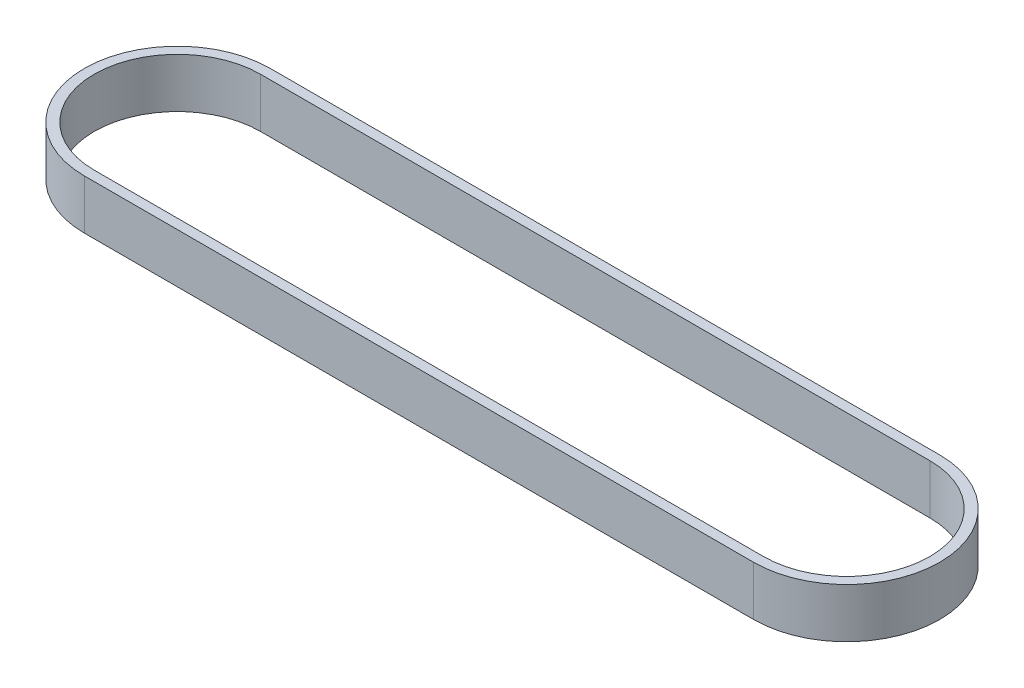
ISO-10303-21;
HEADER;
FILE_DESCRIPTION(('STEP AP214'),'2;1');
FILE_NAME('part.step','',(''),(''),'','','');
FILE_SCHEMA(('AUTOMOTIVE_DESIGN { 1 0 10303 214 1 1 1 1 }'));
ENDSEC;
DATA;
#1=APPLICATION_CONTEXT('core data for automotive mechanical design processes');
#2=APPLICATION_PROTOCOL_DEFINITION('international standard','automotive_design',2000,#1);
#3=PRODUCT_CONTEXT('',#1,'mechanical');
#4=PRODUCT('Part','Part','',(#3));
#5=PRODUCT_RELATED_PRODUCT_CATEGORY('part','',(#4));
#6=PRODUCT_DEFINITION_FORMATION('','',#4);
#7=PRODUCT_DEFINITION_CONTEXT('part definition',#1,'design');
#8=PRODUCT_DEFINITION('design','',#6,#7);
#9=PRODUCT_DEFINITION_SHAPE('','',#8);
#10=(LENGTH_UNIT() NAMED_UNIT(*) SI_UNIT(.MILLI.,.METRE.));
#11=(NAMED_UNIT(*) PLANE_ANGLE_UNIT() SI_UNIT($,.RADIAN.));
#12=(NAMED_UNIT(*) SI_UNIT($,.STERADIAN.) SOLID_ANGLE_UNIT());
#13=UNCERTAINTY_MEASURE_WITH_UNIT(LENGTH_MEASURE(1.E-05),#10,'distance_accuracy_value','');
#14=(GEOMETRIC_REPRESENTATION_CONTEXT(3) GLOBAL_UNCERTAINTY_ASSIGNED_CONTEXT((#13)) GLOBAL_UNIT_ASSIGNED_CONTEXT((#10,
#11,#12)) REPRESENTATION_CONTEXT('',''));
#15=CARTESIAN_POINT('',(0.,0.,0.));
#16=DIRECTION('',(0.,0.,1.));
#17=DIRECTION('',(1.,0.,0.));
#18=AXIS2_PLACEMENT_3D('',#15,#16,#17);
#19=CARTESIAN_POINT('',(0.,10.,0.));
#20=DIRECTION('',(0.,1.,0.));
#21=DIRECTION('',(0.,0.,1.));
#22=AXIS2_PLACEMENT_3D('',#19,#20,#21);
#23=PLANE('',#22);
#24=CARTESIAN_POINT('',(0.,10.,0.));
#25=DIRECTION('',(0.,1.,0.));
#26=DIRECTION('',(1.,0.,0.));
#27=AXIS2_PLACEMENT_3D('',#24,#25,#26);
#28=CIRCLE('',#27,18.76);
#29=CARTESIAN_POINT('',(0.,10.,-18.76));
#30=VERTEX_POINT('',#29);
#31=CARTESIAN_POINT('',(0.,10.,18.76));
#32=VERTEX_POINT('',#31);
#33=EDGE_CURVE('E158',#30,#32,#28,.T.);
#34=ORIENTED_EDGE('',*,*,#33,.T.);
#35=DIRECTION('',(1.,0.,0.));
#36=VECTOR('',#35,1.);
#37=CARTESIAN_POINT('',(0.,10.,18.76));
#38=LINE('',#37,#36);
#39=CARTESIAN_POINT('',(135.,10.,18.76));
#40=VERTEX_POINT('',#39);
#41=EDGE_CURVE('E161',#32,#40,#38,.T.);
#42=ORIENTED_EDGE('',*,*,#41,.T.);
#43=CARTESIAN_POINT('',(135.,10.,0.));
#44=DIRECTION('',(0.,1.,0.));
#45=DIRECTION('',(1.,0.,0.));
#46=AXIS2_PLACEMENT_3D('',#43,#44,#45);
#47=CIRCLE('',#46,18.76);
#48=CARTESIAN_POINT('',(135.,10.,-18.76));
#49=VERTEX_POINT('',#48);
#50=EDGE_CURVE('E164',#40,#49,#47,.T.);
#51=ORIENTED_EDGE('',*,*,#50,.T.);
#52=DIRECTION('',(-1.,0.,0.));
#53=VECTOR('',#52,1.);
#54=CARTESIAN_POINT('',(0.,10.,-18.76));
#55=LINE('',#54,#53);
#56=EDGE_CURVE('E166',#49,#30,#55,.T.);
#57=ORIENTED_EDGE('',*,*,#56,.T.);
#58=EDGE_LOOP('',(#34,#42,#51,#57));
#59=FACE_BOUND('',#58,.T.);
#60=DIRECTION('',(1.,0.,0.));
#61=VECTOR('',#60,1.);
#62=CARTESIAN_POINT('',(0.,10.,16.76));
#63=LINE('',#62,#61);
#64=CARTESIAN_POINT('',(0.,10.,16.76));
#65=VERTEX_POINT('',#64);
#66=CARTESIAN_POINT('',(135.,10.,16.76));
#67=VERTEX_POINT('',#66);
#68=EDGE_CURVE('E130',#65,#67,#63,.T.);
#69=ORIENTED_EDGE('',*,*,#68,.F.);
#70=CARTESIAN_POINT('',(0.,10.,0.));
#71=DIRECTION('',(0.,1.,0.));
#72=DIRECTION('',(1.,0.,0.));
#73=AXIS2_PLACEMENT_3D('',#70,#71,#72);
#74=CIRCLE('',#73,16.76);
#75=CARTESIAN_POINT('',(0.,10.,-16.76));
#76=VERTEX_POINT('',#75);
#77=EDGE_CURVE('E122',#76,#65,#74,.T.);
#78=ORIENTED_EDGE('',*,*,#77,.F.);
#79=DIRECTION('',(-1.,0.,0.));
#80=VECTOR('',#79,1.);
#81=CARTESIAN_POINT('',(0.,10.,-16.76));
#82=LINE('',#81,#80);
#83=CARTESIAN_POINT('',(135.,10.,-16.76));
#84=VERTEX_POINT('',#83);
#85=EDGE_CURVE('E144',#84,#76,#82,.T.);
#86=ORIENTED_EDGE('',*,*,#85,.F.);
#87=CARTESIAN_POINT('',(135.,10.,0.));
#88=DIRECTION('',(0.,1.,0.));
#89=DIRECTION('',(1.,0.,0.));
#90=AXIS2_PLACEMENT_3D('',#87,#88,#89);
#91=CIRCLE('',#90,16.76);
#92=EDGE_CURVE('E142',#67,#84,#91,.T.);
#93=ORIENTED_EDGE('',*,*,#92,.F.);
#94=EDGE_LOOP('',(#69,#78,#86,#93));
#95=FACE_BOUND('',#94,.T.);
#96=ADVANCED_FACE('F57',(#59,#95),#23,.T.);
#97=CARTESIAN_POINT('',(0.,0.,0.));
#98=DIRECTION('',(0.,1.,0.));
#99=DIRECTION('',(0.,0.,1.));
#100=AXIS2_PLACEMENT_3D('',#97,#98,#99);
#101=PLANE('',#100);
#102=CARTESIAN_POINT('',(0.,0.,0.));
#103=DIRECTION('',(0.,1.,0.));
#104=DIRECTION('',(1.,0.,0.));
#105=AXIS2_PLACEMENT_3D('',#102,#103,#104);
#106=CIRCLE('',#105,18.76);
#107=CARTESIAN_POINT('',(0.,0.,-18.76));
#108=VERTEX_POINT('',#107);
#109=CARTESIAN_POINT('',(0.,0.,18.76));
#110=VERTEX_POINT('',#109);
#111=EDGE_CURVE('E138',#108,#110,#106,.T.);
#112=ORIENTED_EDGE('',*,*,#111,.F.);
#113=DIRECTION('',(-1.,0.,0.));
#114=VECTOR('',#113,1.);
#115=CARTESIAN_POINT('',(0.,0.,-18.76));
#116=LINE('',#115,#114);
#117=CARTESIAN_POINT('',(135.,0.,-18.76));
#118=VERTEX_POINT('',#117);
#119=EDGE_CURVE('E162',#118,#108,#116,.T.);
#120=ORIENTED_EDGE('',*,*,#119,.F.);
#121=CARTESIAN_POINT('',(135.,0.,0.));
#122=DIRECTION('',(0.,1.,0.));
#123=DIRECTION('',(1.,0.,0.));
#124=AXIS2_PLACEMENT_3D('',#121,#122,#123);
#125=CIRCLE('',#124,18.76);
#126=CARTESIAN_POINT('',(135.,0.,18.76));
#127=VERTEX_POINT('',#126);
#128=EDGE_CURVE('E173',#127,#118,#125,.T.);
#129=ORIENTED_EDGE('',*,*,#128,.F.);
#130=DIRECTION('',(1.,0.,0.));
#131=VECTOR('',#130,1.);
#132=CARTESIAN_POINT('',(0.,0.,18.76));
#133=LINE('',#132,#131);
#134=EDGE_CURVE('E171',#110,#127,#133,.T.);
#135=ORIENTED_EDGE('',*,*,#134,.F.);
#136=EDGE_LOOP('',(#112,#120,#129,#135));
#137=FACE_BOUND('',#136,.T.);
#138=CARTESIAN_POINT('',(0.,0.,0.));
#139=DIRECTION('',(0.,1.,0.));
#140=DIRECTION('',(1.,0.,0.));
#141=AXIS2_PLACEMENT_3D('',#138,#139,#140);
#142=CIRCLE('',#141,16.76);
#143=CARTESIAN_POINT('',(0.,0.,-16.76));
#144=VERTEX_POINT('',#143);
#145=CARTESIAN_POINT('',(0.,0.,16.76));
#146=VERTEX_POINT('',#145);
#147=EDGE_CURVE('E80',#144,#146,#142,.T.);
#148=ORIENTED_EDGE('',*,*,#147,.T.);
#149=DIRECTION('',(1.,0.,0.));
#150=VECTOR('',#149,1.);
#151=CARTESIAN_POINT('',(0.,0.,16.76));
#152=LINE('',#151,#150);
#153=CARTESIAN_POINT('',(135.,0.,16.76));
#154=VERTEX_POINT('',#153);
#155=EDGE_CURVE('E137',#146,#154,#152,.T.);
#156=ORIENTED_EDGE('',*,*,#155,.T.);
#157=CARTESIAN_POINT('',(135.,0.,0.));
#158=DIRECTION('',(0.,1.,0.));
#159=DIRECTION('',(1.,0.,0.));
#160=AXIS2_PLACEMENT_3D('',#157,#158,#159);
#161=CIRCLE('',#160,16.76);
#162=CARTESIAN_POINT('',(135.,0.,-16.76));
#163=VERTEX_POINT('',#162);
#164=EDGE_CURVE('E150',#154,#163,#161,.T.);
#165=ORIENTED_EDGE('',*,*,#164,.T.);
#166=DIRECTION('',(-1.,0.,0.));
#167=VECTOR('',#166,1.);
#168=CARTESIAN_POINT('',(0.,0.,-16.76));
#169=LINE('',#168,#167);
#170=EDGE_CURVE('E131',#163,#144,#169,.T.);
#171=ORIENTED_EDGE('',*,*,#170,.T.);
#172=EDGE_LOOP('',(#148,#156,#165,#171));
#173=FACE_BOUND('',#172,.T.);
#174=ADVANCED_FACE('F191',(#137,#173),#101,.F.);
#175=CARTESIAN_POINT('',(0.,10.,0.));
#176=DIRECTION('',(0.,-1.,0.));
#177=DIRECTION('',(0.,0.,-1.));
#178=AXIS2_PLACEMENT_3D('',#175,#176,#177);
#179=CYLINDRICAL_SURFACE('',#178,18.76);
#180=ORIENTED_EDGE('',*,*,#111,.T.);
#181=DIRECTION('',(0.,-1.,0.));
#182=VECTOR('',#181,1.);
#183=CARTESIAN_POINT('',(0.,10.,18.76));
#184=LINE('',#183,#182);
#185=EDGE_CURVE('E12',#32,#110,#184,.T.);
#186=ORIENTED_EDGE('',*,*,#185,.F.);
#187=ORIENTED_EDGE('',*,*,#33,.F.);
#188=DIRECTION('',(0.,-1.,0.));
#189=VECTOR('',#188,1.);
#190=CARTESIAN_POINT('',(0.,10.,-18.76));
#191=LINE('',#190,#189);
#192=EDGE_CURVE('E168',#30,#108,#191,.T.);
#193=ORIENTED_EDGE('',*,*,#192,.T.);
#194=EDGE_LOOP('',(#180,#186,#187,#193));
#195=FACE_BOUND('',#194,.T.);
#196=ADVANCED_FACE('F59',(#195),#179,.T.);
#197=CARTESIAN_POINT('',(0.,10.,18.76));
#198=DIRECTION('',(0.,0.,-1.));
#199=DIRECTION('',(-1.,0.,0.));
#200=AXIS2_PLACEMENT_3D('',#197,#198,#199);
#201=PLANE('',#200);
#202=ORIENTED_EDGE('',*,*,#134,.T.);
#203=DIRECTION('',(0.,-1.,0.));
#204=VECTOR('',#203,1.);
#205=CARTESIAN_POINT('',(135.,10.,18.76));
#206=LINE('',#205,#204);
#207=EDGE_CURVE('E65',#40,#127,#206,.T.);
#208=ORIENTED_EDGE('',*,*,#207,.F.);
#209=ORIENTED_EDGE('',*,*,#41,.F.);
#210=ORIENTED_EDGE('',*,*,#185,.T.);
#211=EDGE_LOOP('',(#202,#208,#209,#210));
#212=FACE_BOUND('',#211,.T.);
#213=ADVANCED_FACE('F201',(#212),#201,.F.);
#214=CARTESIAN_POINT('',(135.,10.,0.));
#215=DIRECTION('',(0.,-1.,0.));
#216=DIRECTION('',(0.,0.,-1.));
#217=AXIS2_PLACEMENT_3D('',#214,#215,#216);
#218=CYLINDRICAL_SURFACE('',#217,18.76);
#219=ORIENTED_EDGE('',*,*,#128,.T.);
#220=DIRECTION('',(0.,-1.,0.));
#221=VECTOR('',#220,1.);
#222=CARTESIAN_POINT('',(135.,10.,-18.76));
#223=LINE('',#222,#221);
#224=EDGE_CURVE('E178',#49,#118,#223,.T.);
#225=ORIENTED_EDGE('',*,*,#224,.F.);
#226=ORIENTED_EDGE('',*,*,#50,.F.);
#227=ORIENTED_EDGE('',*,*,#207,.T.);
#228=EDGE_LOOP('',(#219,#225,#226,#227));
#229=FACE_BOUND('',#228,.T.);
#230=ADVANCED_FACE('F185',(#229),#218,.T.);
#231=CARTESIAN_POINT('',(0.,10.,-18.76));
#232=DIRECTION('',(0.,0.,1.));
#233=DIRECTION('',(1.,0.,0.));
#234=AXIS2_PLACEMENT_3D('',#231,#232,#233);
#235=PLANE('',#234);
#236=ORIENTED_EDGE('',*,*,#119,.T.);
#237=ORIENTED_EDGE('',*,*,#192,.F.);
#238=ORIENTED_EDGE('',*,*,#56,.F.);
#239=ORIENTED_EDGE('',*,*,#224,.T.);
#240=EDGE_LOOP('',(#236,#237,#238,#239));
#241=FACE_BOUND('',#240,.T.);
#242=ADVANCED_FACE('F195',(#241),#235,.F.);
#243=CARTESIAN_POINT('',(0.,10.,0.));
#244=DIRECTION('',(0.,-1.,0.));
#245=DIRECTION('',(0.,0.,-1.));
#246=AXIS2_PLACEMENT_3D('',#243,#244,#245);
#247=CYLINDRICAL_SURFACE('',#246,16.76);
#248=ORIENTED_EDGE('',*,*,#147,.F.);
#249=DIRECTION('',(0.,-1.,0.));
#250=VECTOR('',#249,1.);
#251=CARTESIAN_POINT('',(0.,10.,-16.76));
#252=LINE('',#251,#250);
#253=EDGE_CURVE('E126',#76,#144,#252,.T.);
#254=ORIENTED_EDGE('',*,*,#253,.F.);
#255=ORIENTED_EDGE('',*,*,#77,.T.);
#256=DIRECTION('',(0.,-1.,0.));
#257=VECTOR('',#256,1.);
#258=CARTESIAN_POINT('',(0.,10.,16.76));
#259=LINE('',#258,#257);
#260=EDGE_CURVE('E125',#65,#146,#259,.T.);
#261=ORIENTED_EDGE('',*,*,#260,.T.);
#262=EDGE_LOOP('',(#248,#254,#255,#261));
#263=FACE_BOUND('',#262,.T.);
#264=ADVANCED_FACE('F124',(#263),#247,.F.);
#265=CARTESIAN_POINT('',(0.,10.,16.76));
#266=DIRECTION('',(0.,0.,-1.));
#267=DIRECTION('',(-1.,0.,0.));
#268=AXIS2_PLACEMENT_3D('',#265,#266,#267);
#269=PLANE('',#268);
#270=ORIENTED_EDGE('',*,*,#155,.F.);
#271=ORIENTED_EDGE('',*,*,#260,.F.);
#272=ORIENTED_EDGE('',*,*,#68,.T.);
#273=DIRECTION('',(0.,-1.,0.));
#274=VECTOR('',#273,1.);
#275=CARTESIAN_POINT('',(135.,10.,16.76));
#276=LINE('',#275,#274);
#277=EDGE_CURVE('E139',#67,#154,#276,.T.);
#278=ORIENTED_EDGE('',*,*,#277,.T.);
#279=EDGE_LOOP('',(#270,#271,#272,#278));
#280=FACE_BOUND('',#279,.T.);
#281=ADVANCED_FACE('F134',(#280),#269,.T.);
#282=CARTESIAN_POINT('',(135.,10.,0.));
#283=DIRECTION('',(0.,-1.,0.));
#284=DIRECTION('',(0.,0.,-1.));
#285=AXIS2_PLACEMENT_3D('',#282,#283,#284);
#286=CYLINDRICAL_SURFACE('',#285,16.76);
#287=ORIENTED_EDGE('',*,*,#164,.F.);
#288=ORIENTED_EDGE('',*,*,#277,.F.);
#289=ORIENTED_EDGE('',*,*,#92,.T.);
#290=DIRECTION('',(0.,-1.,0.));
#291=VECTOR('',#290,1.);
#292=CARTESIAN_POINT('',(135.,10.,-16.76));
#293=LINE('',#292,#291);
#294=EDGE_CURVE('E72',#84,#163,#293,.T.);
#295=ORIENTED_EDGE('',*,*,#294,.T.);
#296=EDGE_LOOP('',(#287,#288,#289,#295));
#297=FACE_BOUND('',#296,.T.);
#298=ADVANCED_FACE('F224',(#297),#286,.F.);
#299=CARTESIAN_POINT('',(0.,10.,-16.76));
#300=DIRECTION('',(0.,0.,1.));
#301=DIRECTION('',(1.,0.,0.));
#302=AXIS2_PLACEMENT_3D('',#299,#300,#301);
#303=PLANE('',#302);
#304=ORIENTED_EDGE('',*,*,#170,.F.);
#305=ORIENTED_EDGE('',*,*,#294,.F.);
#306=ORIENTED_EDGE('',*,*,#85,.T.);
#307=ORIENTED_EDGE('',*,*,#253,.T.);
#308=EDGE_LOOP('',(#304,#305,#306,#307));
#309=FACE_BOUND('',#308,.T.);
#310=ADVANCED_FACE('F228',(#309),#303,.T.);
#311=CLOSED_SHELL('',(#96,#174,#196,#213,#230,#242,#264,#281,#298,#310));
#312=MANIFOLD_SOLID_BREP('B2',#311);
#313=ADVANCED_BREP_SHAPE_REPRESENTATION('',(#18,#312),#14);
#314=SHAPE_DEFINITION_REPRESENTATION(#9,#313);
ENDSEC;
END-ISO-10303-21;
